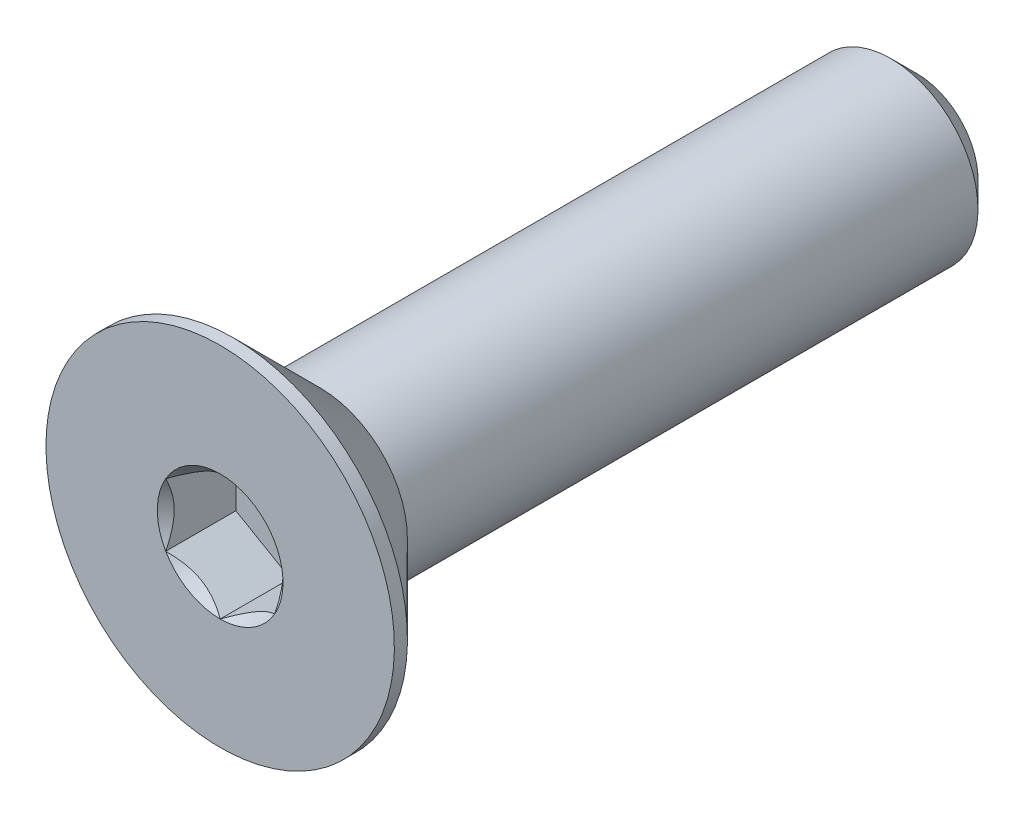
ISO-10303-21;
HEADER;
FILE_DESCRIPTION(('STEP AP214'),'2;1');
FILE_NAME('part.step','',(''),(''),'','','');
FILE_SCHEMA(('AUTOMOTIVE_DESIGN { 1 0 10303 214 1 1 1 1 }'));
ENDSEC;
DATA;
#1=APPLICATION_CONTEXT('core data for automotive mechanical design processes');
#2=APPLICATION_PROTOCOL_DEFINITION('international standard','automotive_design',2000,#1);
#3=PRODUCT_CONTEXT('',#1,'mechanical');
#4=PRODUCT('Part','Part','',(#3));
#5=PRODUCT_RELATED_PRODUCT_CATEGORY('part','',(#4));
#6=PRODUCT_DEFINITION_FORMATION('','',#4);
#7=PRODUCT_DEFINITION_CONTEXT('part definition',#1,'design');
#8=PRODUCT_DEFINITION('design','',#6,#7);
#9=PRODUCT_DEFINITION_SHAPE('','',#8);
#10=(LENGTH_UNIT() NAMED_UNIT(*) SI_UNIT(.MILLI.,.METRE.));
#11=(NAMED_UNIT(*) PLANE_ANGLE_UNIT() SI_UNIT($,.RADIAN.));
#12=(NAMED_UNIT(*) SI_UNIT($,.STERADIAN.) SOLID_ANGLE_UNIT());
#13=UNCERTAINTY_MEASURE_WITH_UNIT(LENGTH_MEASURE(1.E-05),#10,'distance_accuracy_value','');
#14=(GEOMETRIC_REPRESENTATION_CONTEXT(3) GLOBAL_UNCERTAINTY_ASSIGNED_CONTEXT((#13)) GLOBAL_UNIT_ASSIGNED_CONTEXT((#10,
#11,#12)) REPRESENTATION_CONTEXT('',''));
#15=CARTESIAN_POINT('',(0.,0.,0.));
#16=DIRECTION('',(0.,0.,1.));
#17=DIRECTION('',(1.,0.,0.));
#18=AXIS2_PLACEMENT_3D('',#15,#16,#17);
#19=CARTESIAN_POINT('',(0.,0.,-8.));
#20=DIRECTION('',(0.,0.,-1.));
#21=DIRECTION('',(0.,1.,0.));
#22=AXIS2_PLACEMENT_3D('',#19,#20,#21);
#23=CYLINDRICAL_SURFACE('',#22,2.);
#24=CARTESIAN_POINT('',(0.,0.,5.7));
#25=DIRECTION('',(0.,0.,-1.));
#26=DIRECTION('',(0.,1.,0.));
#27=AXIS2_PLACEMENT_3D('',#24,#25,#26);
#28=CIRCLE('',#27,2.);
#29=CARTESIAN_POINT('',(0.,2.,5.7));
#30=VERTEX_POINT('',#29);
#31=EDGE_CURVE('E11',#30,#30,#28,.F.);
#32=ORIENTED_EDGE('',*,*,#31,.F.);
#33=EDGE_LOOP('',(#32));
#34=FACE_BOUND('',#33,.T.);
#35=CARTESIAN_POINT('',(0.,0.,-7.39999999999999));
#36=DIRECTION('',(0.,0.,-1.));
#37=DIRECTION('',(0.,1.,0.));
#38=AXIS2_PLACEMENT_3D('',#35,#36,#37);
#39=CIRCLE('',#38,2.);
#40=CARTESIAN_POINT('',(0.,2.,-7.39999999999999));
#41=VERTEX_POINT('',#40);
#42=EDGE_CURVE('E45',#41,#41,#39,.F.);
#43=ORIENTED_EDGE('',*,*,#42,.T.);
#44=EDGE_LOOP('',(#43));
#45=FACE_BOUND('',#44,.T.);
#46=ADVANCED_FACE('F37',(#34,#45),#23,.T.);
#47=CARTESIAN_POINT('',(0.,2.,-8.));
#48=DIRECTION('',(0.,0.,-1.));
#49=DIRECTION('',(0.,1.,0.));
#50=AXIS2_PLACEMENT_3D('',#47,#48,#49);
#51=PLANE('',#50);
#52=CARTESIAN_POINT('',(0.,0.,-8.));
#53=DIRECTION('',(0.,0.,-1.));
#54=DIRECTION('',(0.,1.,0.));
#55=AXIS2_PLACEMENT_3D('',#52,#53,#54);
#56=CIRCLE('',#55,1.4);
#57=CARTESIAN_POINT('',(0.,1.4,-8.));
#58=VERTEX_POINT('',#57);
#59=EDGE_CURVE('E149',#58,#58,#56,.T.);
#60=ORIENTED_EDGE('',*,*,#59,.T.);
#61=EDGE_LOOP('',(#60));
#62=FACE_BOUND('',#61,.T.);
#63=ADVANCED_FACE('F158',(#62),#51,.T.);
#64=CARTESIAN_POINT('',(0.,0.,-8.));
#65=DIRECTION('',(0.,0.,1.));
#66=DIRECTION('',(0.,-1.,0.));
#67=AXIS2_PLACEMENT_3D('',#64,#65,#66);
#68=CONICAL_SURFACE('',#67,1.4,0.785398163397446);
#69=ORIENTED_EDGE('',*,*,#42,.F.);
#70=EDGE_LOOP('',(#69));
#71=FACE_BOUND('',#70,.T.);
#72=ORIENTED_EDGE('',*,*,#59,.F.);
#73=EDGE_LOOP('',(#72));
#74=FACE_BOUND('',#73,.T.);
#75=ADVANCED_FACE('F39',(#71,#74),#68,.T.);
#76=CARTESIAN_POINT('',(0.,0.,-8.));
#77=DIRECTION('',(0.,0.,-1.));
#78=DIRECTION('',(0.,1.,0.));
#79=AXIS2_PLACEMENT_3D('',#76,#77,#78);
#80=CYLINDRICAL_SURFACE('',#79,4.);
#81=CARTESIAN_POINT('',(0.,0.,8.));
#82=DIRECTION('',(0.,0.,-1.));
#83=DIRECTION('',(0.,1.,0.));
#84=AXIS2_PLACEMENT_3D('',#81,#82,#83);
#85=CIRCLE('',#84,4.);
#86=CARTESIAN_POINT('',(0.,4.,8.));
#87=VERTEX_POINT('',#86);
#88=EDGE_CURVE('E129',#87,#87,#85,.T.);
#89=ORIENTED_EDGE('',*,*,#88,.T.);
#90=EDGE_LOOP('',(#89));
#91=FACE_BOUND('',#90,.T.);
#92=CARTESIAN_POINT('',(0.,0.,7.69999999999999));
#93=DIRECTION('',(0.,0.,-1.));
#94=DIRECTION('',(0.,1.,0.));
#95=AXIS2_PLACEMENT_3D('',#92,#93,#94);
#96=CIRCLE('',#95,4.);
#97=CARTESIAN_POINT('',(0.,4.,7.69999999999999));
#98=VERTEX_POINT('',#97);
#99=EDGE_CURVE('E126',#98,#98,#96,.T.);
#100=ORIENTED_EDGE('',*,*,#99,.F.);
#101=EDGE_LOOP('',(#100));
#102=FACE_BOUND('',#101,.T.);
#103=ADVANCED_FACE('F157',(#91,#102),#80,.T.);
#104=CARTESIAN_POINT('',(0.,0.,5.7));
#105=DIRECTION('',(0.,0.,1.));
#106=DIRECTION('',(0.,-1.,0.));
#107=AXIS2_PLACEMENT_3D('',#104,#105,#106);
#108=CONICAL_SURFACE('',#107,2.,0.78539816339745);
#109=ORIENTED_EDGE('',*,*,#99,.T.);
#110=EDGE_LOOP('',(#109));
#111=FACE_BOUND('',#110,.T.);
#112=ORIENTED_EDGE('',*,*,#31,.T.);
#113=EDGE_LOOP('',(#112));
#114=FACE_BOUND('',#113,.T.);
#115=ADVANCED_FACE('F171',(#111,#114),#108,.T.);
#116=CARTESIAN_POINT('',(0.,0.,8.));
#117=DIRECTION('',(0.,0.,1.));
#118=DIRECTION('',(0.,-1.,0.));
#119=AXIS2_PLACEMENT_3D('',#116,#117,#118);
#120=PLANE('',#119);
#121=CARTESIAN_POINT('',(0.,0.,8.));
#122=DIRECTION('',(0.,0.,1.));
#123=DIRECTION('',(1.,0.,0.));
#124=AXIS2_PLACEMENT_3D('',#121,#122,#123);
#125=CIRCLE('',#124,1.44337567297406);
#126=CARTESIAN_POINT('',(1.25,0.721687836487037,8.));
#127=VERTEX_POINT('',#126);
#128=CARTESIAN_POINT('',(0.,1.44337567297407,8.));
#129=VERTEX_POINT('',#128);
#130=EDGE_CURVE('E96',#127,#129,#125,.T.);
#131=ORIENTED_EDGE('',*,*,#130,.F.);
#132=CARTESIAN_POINT('',(0.,0.,8.));
#133=DIRECTION('',(0.,0.,1.));
#134=DIRECTION('',(1.,0.,0.));
#135=AXIS2_PLACEMENT_3D('',#132,#133,#134);
#136=CIRCLE('',#135,1.44337567297406);
#137=CARTESIAN_POINT('',(1.24999999999999,-0.72168783648704,8.));
#138=VERTEX_POINT('',#137);
#139=EDGE_CURVE('E108',#138,#127,#136,.T.);
#140=ORIENTED_EDGE('',*,*,#139,.F.);
#141=CARTESIAN_POINT('',(0.,0.,8.));
#142=DIRECTION('',(0.,0.,1.));
#143=DIRECTION('',(1.,0.,0.));
#144=AXIS2_PLACEMENT_3D('',#141,#142,#143);
#145=CIRCLE('',#144,1.44337567297406);
#146=CARTESIAN_POINT('',(0.,-1.44337567297406,8.));
#147=VERTEX_POINT('',#146);
#148=EDGE_CURVE('E242',#147,#138,#145,.T.);
#149=ORIENTED_EDGE('',*,*,#148,.F.);
#150=CARTESIAN_POINT('',(0.,0.,8.));
#151=DIRECTION('',(0.,0.,1.));
#152=DIRECTION('',(1.,0.,0.));
#153=AXIS2_PLACEMENT_3D('',#150,#151,#152);
#154=CIRCLE('',#153,1.44337567297406);
#155=CARTESIAN_POINT('',(-1.25,-0.72168783648702,8.));
#156=VERTEX_POINT('',#155);
#157=EDGE_CURVE('E121',#156,#147,#154,.T.);
#158=ORIENTED_EDGE('',*,*,#157,.F.);
#159=CARTESIAN_POINT('',(0.,0.,8.));
#160=DIRECTION('',(0.,0.,1.));
#161=DIRECTION('',(1.,0.,0.));
#162=AXIS2_PLACEMENT_3D('',#159,#160,#161);
#163=CIRCLE('',#162,1.44337567297406);
#164=CARTESIAN_POINT('',(-1.25,0.721687836487031,8.));
#165=VERTEX_POINT('',#164);
#166=EDGE_CURVE('E243',#165,#156,#163,.T.);
#167=ORIENTED_EDGE('',*,*,#166,.F.);
#168=CARTESIAN_POINT('',(0.,0.,8.));
#169=DIRECTION('',(0.,0.,1.));
#170=DIRECTION('',(1.,0.,0.));
#171=AXIS2_PLACEMENT_3D('',#168,#169,#170);
#172=CIRCLE('',#171,1.44337567297406);
#173=EDGE_CURVE('E111',#129,#165,#172,.T.);
#174=ORIENTED_EDGE('',*,*,#173,.F.);
#175=EDGE_LOOP('',(#131,#140,#149,#158,#167,#174));
#176=FACE_BOUND('',#175,.T.);
#177=ORIENTED_EDGE('',*,*,#88,.F.);
#178=EDGE_LOOP('',(#177));
#179=FACE_BOUND('',#178,.T.);
#180=ADVANCED_FACE('F105',(#176,#179),#120,.T.);
#181=CARTESIAN_POINT('',(1.25,0.721687836487033,6.39));
#182=DIRECTION('',(0.5,0.866025403784439,0.));
#183=DIRECTION('',(-0.866025403784439,0.5,0.));
#184=AXIS2_PLACEMENT_3D('',#181,#182,#183);
#185=PLANE('',#184);
#186=DIRECTION('',(0.,0.,1.));
#187=VECTOR('',#186,1.);
#188=CARTESIAN_POINT('',(1.25,0.721687836487033,6.39));
#189=LINE('',#188,#187);
#190=CARTESIAN_POINT('',(1.25,0.721687836487033,6.39));
#191=VERTEX_POINT('',#190);
#192=EDGE_CURVE('E52',#191,#127,#189,.T.);
#193=ORIENTED_EDGE('',*,*,#192,.T.);
#194=CARTESIAN_POINT('',(-0.000199999999999663,1.4434911430279,8.00011548390913));
#195=CARTESIAN_POINT('',(0.0427751670715866,1.41867941875065,7.9753216680551));
#196=CARTESIAN_POINT('',(0.0864690047459476,1.39345276980743,7.95198373441868));
#197=CARTESIAN_POINT('',(0.175565930841941,1.34201263554194,7.90925200408453));
#198=CARTESIAN_POINT('',(0.220977498357063,1.31579425481276,7.88988199236041));
#199=CARTESIAN_POINT('',(0.312547820935258,1.26292610442246,7.85670048341347));
#200=CARTESIAN_POINT('',(0.358683240175884,1.23628980770471,7.84280555905265));
#201=CARTESIAN_POINT('',(0.45197008040759,1.18243062538509,7.82139728216063));
#202=CARTESIAN_POINT('',(0.499118649136377,1.15520938653762,7.81386794156678));
#203=CARTESIAN_POINT('',(0.580373556887249,1.10829684367467,7.8070744980507));
#204=CARTESIAN_POINT('',(0.614374876627937,1.08866617256958,7.80606855910435));
#205=CARTESIAN_POINT('',(0.682317764432473,1.04943932800611,7.80776141491131));
#206=CARTESIAN_POINT('',(0.716259317655653,1.029843163116,7.81046102721553));
#207=CARTESIAN_POINT('',(0.783814856457494,0.990839954603503,7.81940893031637));
#208=CARTESIAN_POINT('',(0.81742850728677,0.971433104248775,7.8256605258997));
#209=CARTESIAN_POINT('',(0.884094638217808,0.932943395609909,7.8413756814139));
#210=CARTESIAN_POINT('',(0.91714687103029,0.913860680098304,7.85084062008745));
#211=CARTESIAN_POINT('',(1.00179969160026,0.864986351354571,7.87893139068758));
#212=CARTESIAN_POINT('',(1.05286649242963,0.835502920149078,7.8996701574522));
#213=CARTESIAN_POINT('',(1.15300085411325,0.77769031947591,7.94638713467147));
#214=CARTESIAN_POINT('',(1.20207431157827,0.749357745598418,7.97234829594676));
#215=CARTESIAN_POINT('',(1.2502,0.721572366433195,8.00011548390913));
#216=B_SPLINE_CURVE_WITH_KNOTS('',3,(#194,#195,#196,#197,#198,#199,#200,#201,#202,#203,#204,
#205,#206,#207,#208,#209,#210,#211,#212,#213,#214,#215),.UNSPECIFIED.,.F.,.F.,(4,2,2,2,2,2,2,2,
2,2,4),(0.,0.166533409618303,0.33403760728976,0.498880396489695,0.66330791924027,
0.780963963458821,0.898645970148447,1.01643764860773,1.13427993171549,1.3214865203214,
1.50809158792574),.UNSPECIFIED.);
#217=EDGE_CURVE('E93',#129,#127,#216,.T.);
#218=ORIENTED_EDGE('',*,*,#217,.F.);
#219=DIRECTION('',(0.,0.,1.));
#220=VECTOR('',#219,1.);
#221=CARTESIAN_POINT('',(0.,1.44337567297406,6.39));
#222=LINE('',#221,#220);
#223=CARTESIAN_POINT('',(0.,1.44337567297406,6.39));
#224=VERTEX_POINT('',#223);
#225=EDGE_CURVE('E145',#224,#129,#222,.T.);
#226=ORIENTED_EDGE('',*,*,#225,.F.);
#227=DIRECTION('',(-0.866025403784439,0.5,0.));
#228=VECTOR('',#227,1.);
#229=CARTESIAN_POINT('',(1.25,0.721687836487033,6.39));
#230=LINE('',#229,#228);
#231=EDGE_CURVE('E118',#191,#224,#230,.T.);
#232=ORIENTED_EDGE('',*,*,#231,.F.);
#233=EDGE_LOOP('',(#193,#218,#226,#232));
#234=FACE_BOUND('',#233,.T.);
#235=ADVANCED_FACE('F123',(#234),#185,.F.);
#236=CARTESIAN_POINT('',(1.25,-0.721687836487033,6.39));
#237=DIRECTION('',(1.,0.,0.));
#238=DIRECTION('',(0.,1.,0.));
#239=AXIS2_PLACEMENT_3D('',#236,#237,#238);
#240=PLANE('',#239);
#241=DIRECTION('',(0.,0.,1.));
#242=VECTOR('',#241,1.);
#243=CARTESIAN_POINT('',(1.25,-0.721687836487033,6.39));
#244=LINE('',#243,#242);
#245=CARTESIAN_POINT('',(1.25,-0.721687836487033,6.39));
#246=VERTEX_POINT('',#245);
#247=EDGE_CURVE('E60',#246,#138,#244,.T.);
#248=ORIENTED_EDGE('',*,*,#247,.T.);
#249=CARTESIAN_POINT('',(1.25,-1.43934010808078,8.46298209689234));
#250=CARTESIAN_POINT('',(1.25,-1.40429313005659,8.4365249226329));
#251=CARTESIAN_POINT('',(1.25,-1.369050871356,8.41032716035429));
#252=CARTESIAN_POINT('',(1.25,-1.29809650706311,8.3585575718396));
#253=CARTESIAN_POINT('',(1.25,-1.26238428576496,8.3329859043563));
#254=CARTESIAN_POINT('',(1.25,-1.15390111792708,8.25700599368947));
#255=CARTESIAN_POINT('',(1.25,-1.08031646726265,8.20774028618957));
#256=CARTESIAN_POINT('',(1.25,-0.926012322755098,8.11102583026314));
#257=CARTESIAN_POINT('',(1.25,-0.845125318656149,8.0638412989418));
#258=CARTESIAN_POINT('',(1.25,-0.679311174076602,7.97753073439042));
#259=CARTESIAN_POINT('',(1.25,-0.594398891026686,7.93837753462691));
#260=CARTESIAN_POINT('',(1.25,-0.466944812460738,7.8904772236883));
#261=CARTESIAN_POINT('',(1.25,-0.426289985812819,7.87672948978634));
#262=CARTESIAN_POINT('',(1.25,-0.343998850091265,7.85249792745054));
#263=CARTESIAN_POINT('',(1.25,-0.302362473614959,7.84201432386977));
#264=CARTESIAN_POINT('',(1.25,-0.219052696285662,7.8250301617483));
#265=CARTESIAN_POINT('',(1.25,-0.177393428474496,7.81846136047137));
#266=CARTESIAN_POINT('',(1.25,-0.0936293693401878,7.80943505345776));
#267=CARTESIAN_POINT('',(1.25,-0.0515246558543913,7.80697684099727));
#268=CARTESIAN_POINT('',(1.25,0.0311890576306367,7.80635406201329));
#269=CARTESIAN_POINT('',(1.25,0.0717969625499358,7.80803711684625));
#270=CARTESIAN_POINT('',(1.25,0.152668636885203,7.81526827059791));
#271=CARTESIAN_POINT('',(1.25,0.192932338835364,7.82081711041311));
#272=CARTESIAN_POINT('',(1.25,0.273499879165302,7.83557103646495));
#273=CARTESIAN_POINT('',(1.25,0.313792180618518,7.84483817596411));
#274=CARTESIAN_POINT('',(1.25,0.393496413911465,7.86653617845735));
#275=CARTESIAN_POINT('',(1.25,0.432908419115066,7.87896677673065));
#276=CARTESIAN_POINT('',(1.25,0.556992735862306,7.92277935293144));
#277=CARTESIAN_POINT('',(1.25,0.639898924666093,7.95915107287596));
#278=CARTESIAN_POINT('',(1.25,0.80181655549971,8.04001916217834));
#279=CARTESIAN_POINT('',(1.25,0.880812666325053,8.08454472091199));
#280=CARTESIAN_POINT('',(1.25,1.03178561279751,8.17640487666663));
#281=CARTESIAN_POINT('',(1.25,1.10391618485086,8.22348993391625));
#282=CARTESIAN_POINT('',(1.25,1.21018606043311,8.29627856159854));
#283=CARTESIAN_POINT('',(1.25,1.2451506996938,8.32079808539336));
#284=CARTESIAN_POINT('',(1.25,1.31460220852737,8.37048563676568));
#285=CARTESIAN_POINT('',(1.25,1.34908920596619,8.39565348541552));
#286=CARTESIAN_POINT('',(1.25,1.38337731682912,8.42109014884121));
#287=B_SPLINE_CURVE_WITH_KNOTS('',3,(#249,#250,#251,#252,#253,#254,#255,#256,#257,#258,#259,
#260,#261,#262,#263,#264,#265,#266,#267,#268,#269,#270,#271,#272,#273,#274,#275,#276,#277,#278,
#279,#280,#281,#282,#283,#284,#285,#286),.UNSPECIFIED.,.F.,.F.,(4,2,2,2,2,2,2,2,2,2,2,2,2,2,2,2,
2,2,4),(0.,0.13173296038145,0.263498984161648,0.529042014455831,0.809741926134628,
1.08947609717227,1.21811634272578,1.34676544783902,1.47310084517846,1.59941451973786,
1.72115042167851,1.84290966131737,1.96679153905343,2.09066305366041,2.36146692896011,
2.63325989198493,2.89154668212281,3.01965734507715,3.1477330224563),.UNSPECIFIED.);
#288=EDGE_CURVE('E117',#127,#138,#287,.F.);
#289=ORIENTED_EDGE('',*,*,#288,.F.);
#290=ORIENTED_EDGE('',*,*,#192,.F.);
#291=DIRECTION('',(0.,1.,0.));
#292=VECTOR('',#291,1.);
#293=CARTESIAN_POINT('',(1.25,-0.721687836487033,6.39));
#294=LINE('',#293,#292);
#295=EDGE_CURVE('E134',#246,#191,#294,.T.);
#296=ORIENTED_EDGE('',*,*,#295,.F.);
#297=EDGE_LOOP('',(#248,#289,#290,#296));
#298=FACE_BOUND('',#297,.T.);
#299=ADVANCED_FACE('F120',(#298),#240,.F.);
#300=CARTESIAN_POINT('',(0.,-1.44337567297406,6.39));
#301=DIRECTION('',(0.5,-0.866025403784439,0.));
#302=DIRECTION('',(0.866025403784439,0.5,0.));
#303=AXIS2_PLACEMENT_3D('',#300,#301,#302);
#304=PLANE('',#303);
#305=DIRECTION('',(0.,0.,1.));
#306=VECTOR('',#305,1.);
#307=CARTESIAN_POINT('',(0.,-1.44337567297406,6.39));
#308=LINE('',#307,#306);
#309=CARTESIAN_POINT('',(0.,-1.44337567297406,6.39));
#310=VERTEX_POINT('',#309);
#311=EDGE_CURVE('E131',#310,#147,#308,.T.);
#312=ORIENTED_EDGE('',*,*,#311,.T.);
#313=CARTESIAN_POINT('',(1.2502,-0.721572366433195,8.00011548390914));
#314=CARTESIAN_POINT('',(1.20722483292841,-0.746384090710445,7.97532166805511));
#315=CARTESIAN_POINT('',(1.16353099525405,-0.771610739653665,7.95198373441869));
#316=CARTESIAN_POINT('',(1.07443406915806,-0.823050873919155,7.90925200408454));
#317=CARTESIAN_POINT('',(1.02902250164294,-0.849269254648333,7.88988199236042));
#318=CARTESIAN_POINT('',(0.937452179064743,-0.902137405038635,7.85670048341349));
#319=CARTESIAN_POINT('',(0.891316759824117,-0.928773701756386,7.84280555905266));
#320=CARTESIAN_POINT('',(0.798029919592411,-0.982632884076011,7.82139728216065));
#321=CARTESIAN_POINT('',(0.750881350863624,-1.00985412292348,7.8138679415668));
#322=CARTESIAN_POINT('',(0.669626443112751,-1.05676666578643,7.80707449805071));
#323=CARTESIAN_POINT('',(0.635625123372063,-1.07639733689152,7.80606855910436));
#324=CARTESIAN_POINT('',(0.567682235567526,-1.11562418145499,7.80776141491133));
#325=CARTESIAN_POINT('',(0.533740682344346,-1.1352203463451,7.81046102721555));
#326=CARTESIAN_POINT('',(0.466185143542504,-1.1742235548576,7.81940893031639));
#327=CARTESIAN_POINT('',(0.432571492713228,-1.19363040521232,7.82566052589971));
#328=CARTESIAN_POINT('',(0.36590536178219,-1.23212011385119,7.84137568141391));
#329=CARTESIAN_POINT('',(0.332853128969707,-1.2512028293628,7.85084062008747));
#330=CARTESIAN_POINT('',(0.248200308399738,-1.30007715810653,7.87893139068759));
#331=CARTESIAN_POINT('',(0.197133507570364,-1.32956058931202,7.89967015745221));
#332=CARTESIAN_POINT('',(0.0969991458867464,-1.38737318998519,7.94638713467149));
#333=CARTESIAN_POINT('',(0.0479256884217313,-1.41570576386268,7.97234829594677));
#334=CARTESIAN_POINT('',(-0.000199999999999823,-1.4434911430279,8.00011548390915));
#335=B_SPLINE_CURVE_WITH_KNOTS('',3,(#313,#314,#315,#316,#317,#318,#319,#320,#321,#322,#323,
#324,#325,#326,#327,#328,#329,#330,#331,#332,#333,#334),.UNSPECIFIED.,.F.,.F.,(4,2,2,2,2,2,2,2,
2,2,4),(0.,0.166533409618302,0.334037607289758,0.498880396489694,0.663307919240268,
0.780963963458821,0.898645970148447,1.01643764860773,1.13427993171549,1.3214865203214,
1.50809158792573),.UNSPECIFIED.);
#336=EDGE_CURVE('E240',#138,#147,#335,.T.);
#337=ORIENTED_EDGE('',*,*,#336,.F.);
#338=ORIENTED_EDGE('',*,*,#247,.F.);
#339=DIRECTION('',(0.866025403784439,0.5,0.));
#340=VECTOR('',#339,1.);
#341=CARTESIAN_POINT('',(0.,-1.44337567297406,6.39));
#342=LINE('',#341,#340);
#343=EDGE_CURVE('E232',#310,#246,#342,.T.);
#344=ORIENTED_EDGE('',*,*,#343,.F.);
#345=EDGE_LOOP('',(#312,#337,#338,#344));
#346=FACE_BOUND('',#345,.T.);
#347=ADVANCED_FACE('F197',(#346),#304,.F.);
#348=CARTESIAN_POINT('',(-1.25,-0.721687836487032,6.39));
#349=DIRECTION('',(-0.5,-0.866025403784438,0.));
#350=DIRECTION('',(0.866025403784439,-0.5,0.));
#351=AXIS2_PLACEMENT_3D('',#348,#349,#350);
#352=PLANE('',#351);
#353=DIRECTION('',(0.,0.,1.));
#354=VECTOR('',#353,1.);
#355=CARTESIAN_POINT('',(-1.25,-0.721687836487032,6.39));
#356=LINE('',#355,#354);
#357=CARTESIAN_POINT('',(-1.25,-0.721687836487032,6.39));
#358=VERTEX_POINT('',#357);
#359=EDGE_CURVE('E139',#358,#156,#356,.T.);
#360=ORIENTED_EDGE('',*,*,#359,.T.);
#361=CARTESIAN_POINT('',(0.000199999999999803,-1.4434911430279,8.00011548390915));
#362=CARTESIAN_POINT('',(-0.0427751670715873,-1.41867941875065,7.97532166805511));
#363=CARTESIAN_POINT('',(-0.086469004745949,-1.39345276980743,7.95198373441869));
#364=CARTESIAN_POINT('',(-0.175565930841943,-1.34201263554194,7.90925200408455));
#365=CARTESIAN_POINT('',(-0.220977498357065,-1.31579425481276,7.88988199236042));
#366=CARTESIAN_POINT('',(-0.312547820935261,-1.26292610442246,7.85670048341349));
#367=CARTESIAN_POINT('',(-0.358683240175887,-1.23628980770471,7.84280555905266));
#368=CARTESIAN_POINT('',(-0.451970080407594,-1.18243062538508,7.82139728216065));
#369=CARTESIAN_POINT('',(-0.499118649136382,-1.15520938653761,7.8138679415668));
#370=CARTESIAN_POINT('',(-0.580373556887255,-1.10829684367467,7.80707449805071));
#371=CARTESIAN_POINT('',(-0.614374876627944,-1.08866617256958,7.80606855910436));
#372=CARTESIAN_POINT('',(-0.68231776443248,-1.04943932800611,7.80776141491133));
#373=CARTESIAN_POINT('',(-0.71625931765566,-1.02984316311599,7.81046102721555));
#374=CARTESIAN_POINT('',(-0.783814856457503,-0.990839954603498,7.81940893031639));
#375=CARTESIAN_POINT('',(-0.817428507286778,-0.971433104248769,7.82566052589971));
#376=CARTESIAN_POINT('',(-0.884094638217817,-0.932943395609903,7.84137568141391));
#377=CARTESIAN_POINT('',(-0.917146871030299,-0.913860680098298,7.85084062008747));
#378=CARTESIAN_POINT('',(-1.00179969160027,-0.864986351354566,7.87893139068759));
#379=CARTESIAN_POINT('',(-1.05286649242964,-0.835502920149074,7.89967015745221));
#380=CARTESIAN_POINT('',(-1.15300085411326,-0.777690319475908,7.94638713467148));
#381=CARTESIAN_POINT('',(-1.20207431157827,-0.749357745598416,7.97234829594677));
#382=CARTESIAN_POINT('',(-1.2502,-0.721572366433195,8.00011548390914));
#383=B_SPLINE_CURVE_WITH_KNOTS('',3,(#361,#362,#363,#364,#365,#366,#367,#368,#369,#370,#371,
#372,#373,#374,#375,#376,#377,#378,#379,#380,#381,#382),.UNSPECIFIED.,.F.,.F.,(4,2,2,2,2,2,2,2,
2,2,4),(0.,0.166533409618305,0.334037607289762,0.4988803964897,0.663307919240277,
0.78096396345883,0.898645970148456,1.01643764860774,1.1342799317155,1.32148652032141,
1.50809158792573),.UNSPECIFIED.);
#384=EDGE_CURVE('E214',#147,#156,#383,.T.);
#385=ORIENTED_EDGE('',*,*,#384,.F.);
#386=ORIENTED_EDGE('',*,*,#311,.F.);
#387=DIRECTION('',(0.866025403784438,-0.5,0.));
#388=VECTOR('',#387,1.);
#389=CARTESIAN_POINT('',(-1.25,-0.721687836487032,6.39));
#390=LINE('',#389,#388);
#391=EDGE_CURVE('E230',#358,#310,#390,.T.);
#392=ORIENTED_EDGE('',*,*,#391,.F.);
#393=EDGE_LOOP('',(#360,#385,#386,#392));
#394=FACE_BOUND('',#393,.T.);
#395=ADVANCED_FACE('F193',(#394),#352,.F.);
#396=CARTESIAN_POINT('',(-1.25,0.721687836487033,6.39));
#397=DIRECTION('',(-1.,0.,0.));
#398=DIRECTION('',(0.,0.,1.));
#399=AXIS2_PLACEMENT_3D('',#396,#397,#398);
#400=PLANE('',#399);
#401=DIRECTION('',(0.,0.,1.));
#402=VECTOR('',#401,1.);
#403=CARTESIAN_POINT('',(-1.25,0.721687836487033,6.39));
#404=LINE('',#403,#402);
#405=CARTESIAN_POINT('',(-1.25,0.721687836487033,6.39));
#406=VERTEX_POINT('',#405);
#407=EDGE_CURVE('E142',#406,#165,#404,.T.);
#408=ORIENTED_EDGE('',*,*,#407,.T.);
#409=CARTESIAN_POINT('',(-1.25,-1.43934010808078,8.46298209689234));
#410=CARTESIAN_POINT('',(-1.25,-1.40429313005659,8.4365249226329));
#411=CARTESIAN_POINT('',(-1.25,-1.369050871356,8.41032716035429));
#412=CARTESIAN_POINT('',(-1.25,-1.29809650706311,8.35855757183959));
#413=CARTESIAN_POINT('',(-1.25,-1.26238428576496,8.3329859043563));
#414=CARTESIAN_POINT('',(-1.25,-1.15390111792708,8.25700599368947));
#415=CARTESIAN_POINT('',(-1.25,-1.08031646726265,8.20774028618957));
#416=CARTESIAN_POINT('',(-1.25,-0.926012322755096,8.11102583026314));
#417=CARTESIAN_POINT('',(-1.25,-0.845125318656147,8.0638412989418));
#418=CARTESIAN_POINT('',(-1.25,-0.679311174076601,7.97753073439042));
#419=CARTESIAN_POINT('',(-1.25,-0.594398891026686,7.93837753462691));
#420=CARTESIAN_POINT('',(-1.25,-0.466944812460738,7.8904772236883));
#421=CARTESIAN_POINT('',(-1.25,-0.426289985812819,7.87672948978634));
#422=CARTESIAN_POINT('',(-1.25,-0.343998850091265,7.85249792745055));
#423=CARTESIAN_POINT('',(-1.25,-0.302362473614959,7.84201432386978));
#424=CARTESIAN_POINT('',(-1.25,-0.219052696285662,7.8250301617483));
#425=CARTESIAN_POINT('',(-1.25,-0.177393428474496,7.81846136047137));
#426=CARTESIAN_POINT('',(-1.25,-0.0936293693401879,7.80943505345776));
#427=CARTESIAN_POINT('',(-1.25,-0.0515246558543913,7.80697684099727));
#428=CARTESIAN_POINT('',(-1.25,0.0311890576306369,7.80635406201329));
#429=CARTESIAN_POINT('',(-1.25,0.071796962549936,7.80803711684625));
#430=CARTESIAN_POINT('',(-1.25,0.152668636885203,7.81526827059792));
#431=CARTESIAN_POINT('',(-1.25,0.192932338835364,7.82081711041311));
#432=CARTESIAN_POINT('',(-1.25,0.273499879165302,7.83557103646496));
#433=CARTESIAN_POINT('',(-1.25,0.313792180618518,7.84483817596411));
#434=CARTESIAN_POINT('',(-1.25,0.393496413911464,7.86653617845735));
#435=CARTESIAN_POINT('',(-1.25,0.432908419115066,7.87896677673065));
#436=CARTESIAN_POINT('',(-1.25,0.556992735862305,7.92277935293144));
#437=CARTESIAN_POINT('',(-1.25,0.639898924666092,7.95915107287596));
#438=CARTESIAN_POINT('',(-1.25,0.801816555499708,8.04001916217833));
#439=CARTESIAN_POINT('',(-1.25,0.880812666325051,8.08454472091199));
#440=CARTESIAN_POINT('',(-1.25,1.0317856127975,8.17640487666663));
#441=CARTESIAN_POINT('',(-1.25,1.10391618485086,8.22348993391625));
#442=CARTESIAN_POINT('',(-1.25,1.21018606043311,8.29627856159854));
#443=CARTESIAN_POINT('',(-1.25,1.2451506996938,8.32079808539336));
#444=CARTESIAN_POINT('',(-1.25,1.31460220852737,8.37048563676568));
#445=CARTESIAN_POINT('',(-1.25,1.34908920596618,8.39565348541552));
#446=CARTESIAN_POINT('',(-1.25,1.38337731682912,8.42109014884121));
#447=B_SPLINE_CURVE_WITH_KNOTS('',3,(#409,#410,#411,#412,#413,#414,#415,#416,#417,#418,#419,
#420,#421,#422,#423,#424,#425,#426,#427,#428,#429,#430,#431,#432,#433,#434,#435,#436,#437,#438,
#439,#440,#441,#442,#443,#444,#445,#446),.UNSPECIFIED.,.F.,.F.,(4,2,2,2,2,2,2,2,2,2,2,2,2,2,2,2,
2,2,4),(0.,0.13173296038145,0.263498984161646,0.529042014455831,0.809741926134626,
1.08947609717226,1.21811634272578,1.34676544783902,1.47310084517845,1.59941451973786,
1.72115042167851,1.84290966131736,1.96679153905343,2.09066305366041,2.3614669289601,
2.63325989198492,2.8915466821228,3.01965734507714,3.14773302245629),.UNSPECIFIED.);
#448=EDGE_CURVE('E99',#156,#165,#447,.T.);
#449=ORIENTED_EDGE('',*,*,#448,.F.);
#450=ORIENTED_EDGE('',*,*,#359,.F.);
#451=DIRECTION('',(0.,-1.,0.));
#452=VECTOR('',#451,1.);
#453=CARTESIAN_POINT('',(-1.25,0.721687836487033,6.39));
#454=LINE('',#453,#452);
#455=EDGE_CURVE('E227',#406,#358,#454,.T.);
#456=ORIENTED_EDGE('',*,*,#455,.F.);
#457=EDGE_LOOP('',(#408,#449,#450,#456));
#458=FACE_BOUND('',#457,.T.);
#459=ADVANCED_FACE('F189',(#458),#400,.F.);
#460=CARTESIAN_POINT('',(0.,1.44337567297406,6.39));
#461=DIRECTION('',(-0.5,0.866025403784439,0.));
#462=DIRECTION('',(-0.866025403784439,-0.5,0.));
#463=AXIS2_PLACEMENT_3D('',#460,#461,#462);
#464=PLANE('',#463);
#465=ORIENTED_EDGE('',*,*,#225,.T.);
#466=CARTESIAN_POINT('',(-1.2502,0.721572366433195,8.00011548390913));
#467=CARTESIAN_POINT('',(-1.20722483292841,0.746384090710444,7.9753216680551));
#468=CARTESIAN_POINT('',(-1.16353099525405,0.771610739653665,7.95198373441868));
#469=CARTESIAN_POINT('',(-1.07443406915806,0.823050873919155,7.90925200408453));
#470=CARTESIAN_POINT('',(-1.02902250164294,0.849269254648334,7.88988199236041));
#471=CARTESIAN_POINT('',(-0.937452179064739,0.902137405038637,7.85670048341347));
#472=CARTESIAN_POINT('',(-0.891316759824113,0.928773701756388,7.84280555905265));
#473=CARTESIAN_POINT('',(-0.798029919592406,0.982632884076014,7.82139728216063));
#474=CARTESIAN_POINT('',(-0.750881350863618,1.00985412292349,7.81386794156678));
#475=CARTESIAN_POINT('',(-0.669626443112746,1.05676666578643,7.8070744980507));
#476=CARTESIAN_POINT('',(-0.635625123372057,1.07639733689152,7.80606855910435));
#477=CARTESIAN_POINT('',(-0.567682235567521,1.11562418145499,7.80776141491131));
#478=CARTESIAN_POINT('',(-0.533740682344341,1.1352203463451,7.81046102721553));
#479=CARTESIAN_POINT('',(-0.4661851435425,1.1742235548576,7.81940893031637));
#480=CARTESIAN_POINT('',(-0.432571492713224,1.19363040521233,7.8256605258997));
#481=CARTESIAN_POINT('',(-0.365905361782186,1.23212011385119,7.8413756814139));
#482=CARTESIAN_POINT('',(-0.332853128969704,1.2512028293628,7.85084062008745));
#483=CARTESIAN_POINT('',(-0.248200308399735,1.30007715810653,7.87893139068758));
#484=CARTESIAN_POINT('',(-0.197133507570361,1.32956058931202,7.89967015745219));
#485=CARTESIAN_POINT('',(-0.0969991458867447,1.38737318998519,7.94638713467147));
#486=CARTESIAN_POINT('',(-0.0479256884217302,1.41570576386268,7.97234829594676));
#487=CARTESIAN_POINT('',(0.00020000000000057,1.4434911430279,8.00011548390913));
#488=B_SPLINE_CURVE_WITH_KNOTS('',3,(#466,#467,#468,#469,#470,#471,#472,#473,#474,#475,#476,
#477,#478,#479,#480,#481,#482,#483,#484,#485,#486,#487),.UNSPECIFIED.,.F.,.F.,(4,2,2,2,2,2,2,2,
2,2,4),(0.,0.166533409618304,0.334037607289764,0.498880396489701,0.663307919240277,
0.780963963458829,0.898645970148455,1.01643764860773,1.1342799317155,1.32148652032141,
1.50809158792574),.UNSPECIFIED.);
#489=EDGE_CURVE('E236',#165,#129,#488,.T.);
#490=ORIENTED_EDGE('',*,*,#489,.F.);
#491=ORIENTED_EDGE('',*,*,#407,.F.);
#492=DIRECTION('',(-0.866025403784439,-0.5,0.));
#493=VECTOR('',#492,1.);
#494=CARTESIAN_POINT('',(0.,1.44337567297406,6.39));
#495=LINE('',#494,#493);
#496=EDGE_CURVE('E224',#224,#406,#495,.T.);
#497=ORIENTED_EDGE('',*,*,#496,.F.);
#498=EDGE_LOOP('',(#465,#490,#491,#497));
#499=FACE_BOUND('',#498,.T.);
#500=ADVANCED_FACE('F185',(#499),#464,.F.);
#501=CARTESIAN_POINT('',(0.,0.,6.39));
#502=DIRECTION('',(0.,0.,1.));
#503=DIRECTION('',(1.,0.,0.));
#504=AXIS2_PLACEMENT_3D('',#501,#502,#503);
#505=PLANE('',#504);
#506=ORIENTED_EDGE('',*,*,#231,.T.);
#507=ORIENTED_EDGE('',*,*,#496,.T.);
#508=ORIENTED_EDGE('',*,*,#455,.T.);
#509=ORIENTED_EDGE('',*,*,#391,.T.);
#510=ORIENTED_EDGE('',*,*,#343,.T.);
#511=ORIENTED_EDGE('',*,*,#295,.T.);
#512=EDGE_LOOP('',(#506,#507,#508,#509,#510,#511));
#513=FACE_BOUND('',#512,.T.);
#514=ADVANCED_FACE('F188',(#513),#505,.T.);
#515=CARTESIAN_POINT('',(0.,0.,8.));
#516=DIRECTION('',(0.,0.,1.));
#517=DIRECTION('',(1.,0.,0.));
#518=AXIS2_PLACEMENT_3D('',#515,#516,#517);
#519=CONICAL_SURFACE('',#518,1.44337567297406,0.78539816339745);
#520=ORIENTED_EDGE('',*,*,#489,.T.);
#521=ORIENTED_EDGE('',*,*,#173,.T.);
#522=EDGE_LOOP('',(#520,#521));
#523=FACE_BOUND('',#522,.T.);
#524=ADVANCED_FACE('F204',(#523),#519,.F.);
#525=CARTESIAN_POINT('',(0.,0.,8.));
#526=DIRECTION('',(0.,0.,1.));
#527=DIRECTION('',(1.,0.,0.));
#528=AXIS2_PLACEMENT_3D('',#525,#526,#527);
#529=CONICAL_SURFACE('',#528,1.44337567297406,0.78539816339745);
#530=ORIENTED_EDGE('',*,*,#384,.T.);
#531=ORIENTED_EDGE('',*,*,#157,.T.);
#532=EDGE_LOOP('',(#530,#531));
#533=FACE_BOUND('',#532,.T.);
#534=ADVANCED_FACE('F206',(#533),#529,.F.);
#535=CARTESIAN_POINT('',(0.,0.,8.));
#536=DIRECTION('',(0.,0.,1.));
#537=DIRECTION('',(1.,0.,0.));
#538=AXIS2_PLACEMENT_3D('',#535,#536,#537);
#539=CONICAL_SURFACE('',#538,1.44337567297406,0.78539816339745);
#540=ORIENTED_EDGE('',*,*,#288,.T.);
#541=ORIENTED_EDGE('',*,*,#139,.T.);
#542=EDGE_LOOP('',(#540,#541));
#543=FACE_BOUND('',#542,.T.);
#544=ADVANCED_FACE('F116',(#543),#539,.F.);
#545=CARTESIAN_POINT('',(0.,0.,8.));
#546=DIRECTION('',(0.,0.,1.));
#547=DIRECTION('',(1.,0.,0.));
#548=AXIS2_PLACEMENT_3D('',#545,#546,#547);
#549=CONICAL_SURFACE('',#548,1.44337567297406,0.78539816339745);
#550=ORIENTED_EDGE('',*,*,#336,.T.);
#551=ORIENTED_EDGE('',*,*,#148,.T.);
#552=EDGE_LOOP('',(#550,#551));
#553=FACE_BOUND('',#552,.T.);
#554=ADVANCED_FACE('F255',(#553),#549,.F.);
#555=CARTESIAN_POINT('',(0.,0.,8.));
#556=DIRECTION('',(0.,0.,1.));
#557=DIRECTION('',(1.,0.,0.));
#558=AXIS2_PLACEMENT_3D('',#555,#556,#557);
#559=CONICAL_SURFACE('',#558,1.44337567297406,0.78539816339745);
#560=ORIENTED_EDGE('',*,*,#448,.T.);
#561=ORIENTED_EDGE('',*,*,#166,.T.);
#562=EDGE_LOOP('',(#560,#561));
#563=FACE_BOUND('',#562,.T.);
#564=ADVANCED_FACE('F260',(#563),#559,.F.);
#565=CARTESIAN_POINT('',(0.,0.,8.));
#566=DIRECTION('',(0.,0.,1.));
#567=DIRECTION('',(1.,0.,0.));
#568=AXIS2_PLACEMENT_3D('',#565,#566,#567);
#569=CONICAL_SURFACE('',#568,1.44337567297406,0.78539816339745);
#570=ORIENTED_EDGE('',*,*,#217,.T.);
#571=ORIENTED_EDGE('',*,*,#130,.T.);
#572=EDGE_LOOP('',(#570,#571));
#573=FACE_BOUND('',#572,.T.);
#574=ADVANCED_FACE('F95',(#573),#569,.F.);
#575=CLOSED_SHELL('',(#46,#63,#75,#103,#115,#180,#235,#299,#347,#395,#459,#500,#514,#524,#534,
#544,#554,#564,#574));
#576=MANIFOLD_SOLID_BREP('B2',#575);
#577=ADVANCED_BREP_SHAPE_REPRESENTATION('',(#18,#576),#14);
#578=SHAPE_DEFINITION_REPRESENTATION(#9,#577);
ENDSEC;
END-ISO-10303-21;
